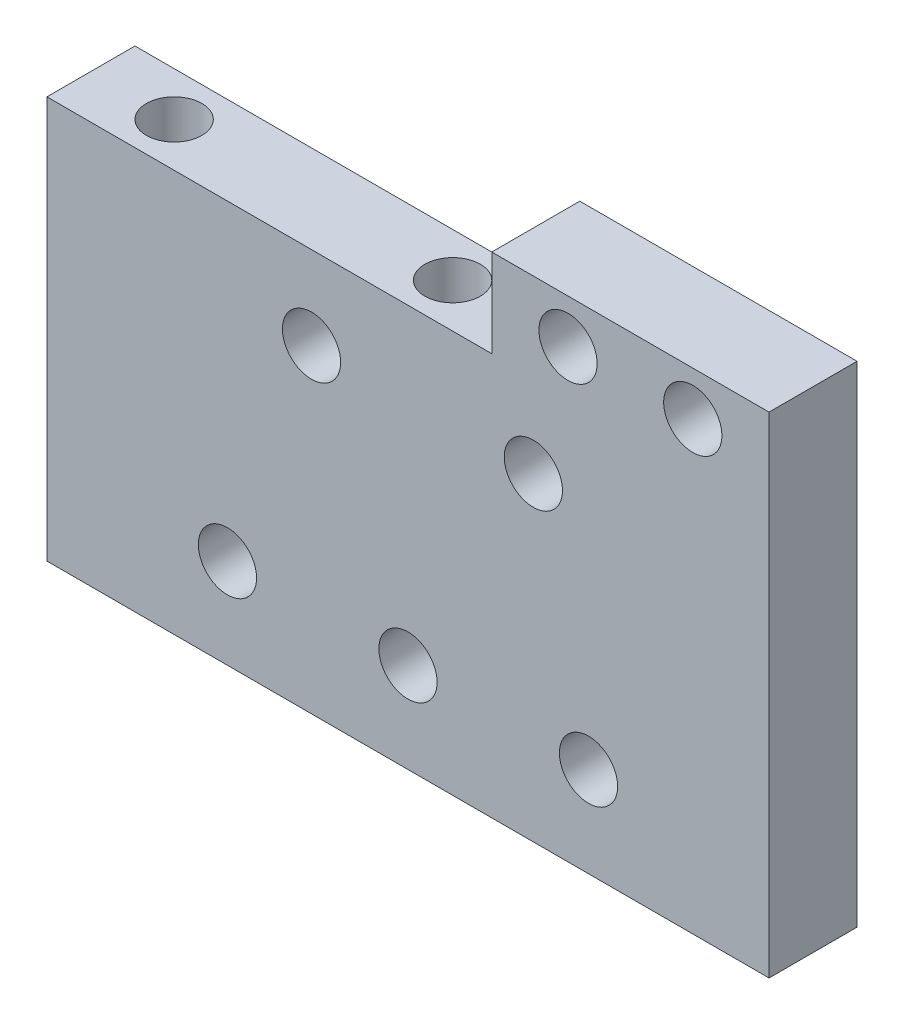
ISO-10303-21;
HEADER;
FILE_DESCRIPTION(('STEP AP214'),'2;1');
FILE_NAME('part.step','',(''),(''),'','','');
FILE_SCHEMA(('AUTOMOTIVE_DESIGN { 1 0 10303 214 1 1 1 1 }'));
ENDSEC;
DATA;
#1=APPLICATION_CONTEXT('core data for automotive mechanical design processes');
#2=APPLICATION_PROTOCOL_DEFINITION('international standard','automotive_design',2000,#1);
#3=PRODUCT_CONTEXT('',#1,'mechanical');
#4=PRODUCT('Part','Part','',(#3));
#5=PRODUCT_RELATED_PRODUCT_CATEGORY('part','',(#4));
#6=PRODUCT_DEFINITION_FORMATION('','',#4);
#7=PRODUCT_DEFINITION_CONTEXT('part definition',#1,'design');
#8=PRODUCT_DEFINITION('design','',#6,#7);
#9=PRODUCT_DEFINITION_SHAPE('','',#8);
#10=(LENGTH_UNIT() NAMED_UNIT(*) SI_UNIT(.MILLI.,.METRE.));
#11=(NAMED_UNIT(*) PLANE_ANGLE_UNIT() SI_UNIT($,.RADIAN.));
#12=(NAMED_UNIT(*) SI_UNIT($,.STERADIAN.) SOLID_ANGLE_UNIT());
#13=UNCERTAINTY_MEASURE_WITH_UNIT(LENGTH_MEASURE(1.E-05),#10,'distance_accuracy_value','');
#14=(GEOMETRIC_REPRESENTATION_CONTEXT(3) GLOBAL_UNCERTAINTY_ASSIGNED_CONTEXT((#13)) GLOBAL_UNIT_ASSIGNED_CONTEXT((#10,
#11,#12)) REPRESENTATION_CONTEXT('',''));
#15=CARTESIAN_POINT('',(0.,0.,0.));
#16=DIRECTION('',(0.,0.,1.));
#17=DIRECTION('',(1.,0.,0.));
#18=AXIS2_PLACEMENT_3D('',#15,#16,#17);
#19=CARTESIAN_POINT('',(89.9999999999999,0.,6.35));
#20=DIRECTION('',(0.,0.,-1.));
#21=DIRECTION('',(-1.,0.,0.));
#22=AXIS2_PLACEMENT_3D('',#19,#20,#21);
#23=PLANE('',#22);
#24=CARTESIAN_POINT('',(77.,-5.99999999999999,6.35));
#25=DIRECTION('',(0.,0.,1.));
#26=DIRECTION('',(1.,0.,0.));
#27=AXIS2_PLACEMENT_3D('',#24,#25,#26);
#28=CIRCLE('',#27,2.10000000000002);
#29=CARTESIAN_POINT('',(79.1,-5.99999999999999,6.35));
#30=VERTEX_POINT('',#29);
#31=EDGE_CURVE('E217',#30,#30,#28,.T.);
#32=ORIENTED_EDGE('',*,*,#31,.F.);
#33=EDGE_LOOP('',(#32));
#34=FACE_BOUND('',#33,.T.);
#35=CARTESIAN_POINT('',(93.,-5.99999999999999,6.35));
#36=DIRECTION('',(0.,0.,1.));
#37=DIRECTION('',(1.,0.,0.));
#38=AXIS2_PLACEMENT_3D('',#35,#36,#37);
#39=CIRCLE('',#38,2.10000000000002);
#40=CARTESIAN_POINT('',(95.1,-5.99999999999999,6.35));
#41=VERTEX_POINT('',#40);
#42=EDGE_CURVE('E222',#41,#41,#39,.T.);
#43=ORIENTED_EDGE('',*,*,#42,.F.);
#44=EDGE_LOOP('',(#43));
#45=FACE_BOUND('',#44,.T.);
#46=CARTESIAN_POINT('',(96.9786264722931,-22.5,6.35));
#47=DIRECTION('',(0.,0.,1.));
#48=DIRECTION('',(1.,0.,0.));
#49=AXIS2_PLACEMENT_3D('',#46,#47,#48);
#50=CIRCLE('',#49,2.10000000000002);
#51=CARTESIAN_POINT('',(99.0786264722931,-22.5,6.35));
#52=VERTEX_POINT('',#51);
#53=EDGE_CURVE('E228',#52,#52,#50,.T.);
#54=ORIENTED_EDGE('',*,*,#53,.F.);
#55=EDGE_LOOP('',(#54));
#56=FACE_BOUND('',#55,.T.);
#57=CARTESIAN_POINT('',(83.9572529445862,-22.5,6.35));
#58=DIRECTION('',(0.,0.,1.));
#59=DIRECTION('',(1.,0.,0.));
#60=AXIS2_PLACEMENT_3D('',#57,#58,#59);
#61=CIRCLE('',#60,2.10000000000002);
#62=CARTESIAN_POINT('',(86.0572529445862,-22.5,6.35));
#63=VERTEX_POINT('',#62);
#64=EDGE_CURVE('E234',#63,#63,#61,.T.);
#65=ORIENTED_EDGE('',*,*,#64,.F.);
#66=EDGE_LOOP('',(#65));
#67=FACE_BOUND('',#66,.T.);
#68=CARTESIAN_POINT('',(70.9358794168792,-22.5,6.35));
#69=DIRECTION('',(0.,0.,1.));
#70=DIRECTION('',(1.,0.,0.));
#71=AXIS2_PLACEMENT_3D('',#68,#69,#70);
#72=CIRCLE('',#71,2.10000000000002);
#73=CARTESIAN_POINT('',(73.0358794168793,-22.5,6.35));
#74=VERTEX_POINT('',#73);
#75=EDGE_CURVE('E240',#74,#74,#72,.T.);
#76=ORIENTED_EDGE('',*,*,#75,.F.);
#77=EDGE_LOOP('',(#76));
#78=FACE_BOUND('',#77,.T.);
#79=CARTESIAN_POINT('',(95.5,3.175,6.35));
#80=DIRECTION('',(0.,0.,1.));
#81=DIRECTION('',(1.,0.,0.));
#82=AXIS2_PLACEMENT_3D('',#79,#80,#81);
#83=CIRCLE('',#82,2.1);
#84=CARTESIAN_POINT('',(97.6,3.175,6.35));
#85=VERTEX_POINT('',#84);
#86=EDGE_CURVE('E120',#85,#85,#83,.T.);
#87=ORIENTED_EDGE('',*,*,#86,.F.);
#88=EDGE_LOOP('',(#87));
#89=FACE_BOUND('',#88,.T.);
#90=DIRECTION('',(0.,-1.,0.));
#91=VECTOR('',#90,1.);
#92=CARTESIAN_POINT('',(89.9999999999999,6.35,6.35));
#93=LINE('',#92,#91);
#94=CARTESIAN_POINT('',(89.9999999999999,6.35,6.35));
#95=VERTEX_POINT('',#94);
#96=CARTESIAN_POINT('',(89.9999999999999,0.,6.35));
#97=VERTEX_POINT('',#96);
#98=EDGE_CURVE('E127',#95,#97,#93,.T.);
#99=ORIENTED_EDGE('',*,*,#98,.T.);
#100=DIRECTION('',(-1.,0.,0.));
#101=VECTOR('',#100,1.);
#102=CARTESIAN_POINT('',(89.9999999999999,0.,6.35));
#103=LINE('',#102,#101);
#104=CARTESIAN_POINT('',(57.9145058891723,0.,6.35));
#105=VERTEX_POINT('',#104);
#106=EDGE_CURVE('E85',#97,#105,#103,.T.);
#107=ORIENTED_EDGE('',*,*,#106,.T.);
#108=DIRECTION('',(0.,-1.,0.));
#109=VECTOR('',#108,1.);
#110=CARTESIAN_POINT('',(57.9145058891723,0.,6.35));
#111=LINE('',#110,#109);
#112=CARTESIAN_POINT('',(57.9145058891723,-29.,6.35));
#113=VERTEX_POINT('',#112);
#114=EDGE_CURVE('E98',#105,#113,#111,.T.);
#115=ORIENTED_EDGE('',*,*,#114,.T.);
#116=DIRECTION('',(1.,0.,0.));
#117=VECTOR('',#116,1.);
#118=CARTESIAN_POINT('',(57.9145058891723,-29.,6.35));
#119=LINE('',#118,#117);
#120=CARTESIAN_POINT('',(110.,-29.,6.35));
#121=VERTEX_POINT('',#120);
#122=EDGE_CURVE('E92',#113,#121,#119,.T.);
#123=ORIENTED_EDGE('',*,*,#122,.T.);
#124=DIRECTION('',(0.,1.,0.));
#125=VECTOR('',#124,1.);
#126=CARTESIAN_POINT('',(110.,6.35,6.35));
#127=LINE('',#126,#125);
#128=CARTESIAN_POINT('',(110.,6.35,6.35));
#129=VERTEX_POINT('',#128);
#130=EDGE_CURVE('E96',#121,#129,#127,.T.);
#131=ORIENTED_EDGE('',*,*,#130,.T.);
#132=DIRECTION('',(-1.,0.,0.));
#133=VECTOR('',#132,1.);
#134=CARTESIAN_POINT('',(89.9999999999999,6.35,6.35));
#135=LINE('',#134,#133);
#136=EDGE_CURVE('E48',#129,#95,#135,.T.);
#137=ORIENTED_EDGE('',*,*,#136,.T.);
#138=EDGE_LOOP('',(#99,#107,#115,#123,#131,#137));
#139=FACE_BOUND('',#138,.T.);
#140=CARTESIAN_POINT('',(104.5,3.175,6.35));
#141=DIRECTION('',(0.,0.,1.));
#142=DIRECTION('',(1.,0.,0.));
#143=AXIS2_PLACEMENT_3D('',#140,#141,#142);
#144=CIRCLE('',#143,2.1);
#145=CARTESIAN_POINT('',(106.6,3.175,6.35));
#146=VERTEX_POINT('',#145);
#147=EDGE_CURVE('E249',#146,#146,#144,.T.);
#148=ORIENTED_EDGE('',*,*,#147,.F.);
#149=EDGE_LOOP('',(#148));
#150=FACE_BOUND('',#149,.T.);
#151=ADVANCED_FACE('F31',(#34,#45,#56,#67,#78,#89,#139,#150),#23,.F.);
#152=CARTESIAN_POINT('',(89.9999999999999,0.,0.));
#153=DIRECTION('',(0.,0.,-1.));
#154=DIRECTION('',(-1.,0.,0.));
#155=AXIS2_PLACEMENT_3D('',#152,#153,#154);
#156=PLANE('',#155);
#157=CARTESIAN_POINT('',(77.,-5.99999999999999,0.));
#158=DIRECTION('',(0.,0.,1.));
#159=DIRECTION('',(1.,0.,0.));
#160=AXIS2_PLACEMENT_3D('',#157,#158,#159);
#161=CIRCLE('',#160,2.10000000000002);
#162=CARTESIAN_POINT('',(79.1,-5.99999999999999,0.));
#163=VERTEX_POINT('',#162);
#164=EDGE_CURVE('E219',#163,#163,#161,.T.);
#165=ORIENTED_EDGE('',*,*,#164,.T.);
#166=EDGE_LOOP('',(#165));
#167=FACE_BOUND('',#166,.T.);
#168=CARTESIAN_POINT('',(93.,-5.99999999999999,0.));
#169=DIRECTION('',(0.,0.,1.));
#170=DIRECTION('',(1.,0.,0.));
#171=AXIS2_PLACEMENT_3D('',#168,#169,#170);
#172=CIRCLE('',#171,2.10000000000002);
#173=CARTESIAN_POINT('',(95.1,-5.99999999999999,0.));
#174=VERTEX_POINT('',#173);
#175=EDGE_CURVE('E225',#174,#174,#172,.T.);
#176=ORIENTED_EDGE('',*,*,#175,.T.);
#177=EDGE_LOOP('',(#176));
#178=FACE_BOUND('',#177,.T.);
#179=CARTESIAN_POINT('',(96.9786264722931,-22.5,0.));
#180=DIRECTION('',(0.,0.,1.));
#181=DIRECTION('',(1.,0.,0.));
#182=AXIS2_PLACEMENT_3D('',#179,#180,#181);
#183=CIRCLE('',#182,2.10000000000002);
#184=CARTESIAN_POINT('',(99.0786264722931,-22.5,0.));
#185=VERTEX_POINT('',#184);
#186=EDGE_CURVE('E231',#185,#185,#183,.T.);
#187=ORIENTED_EDGE('',*,*,#186,.T.);
#188=EDGE_LOOP('',(#187));
#189=FACE_BOUND('',#188,.T.);
#190=CARTESIAN_POINT('',(83.9572529445862,-22.5,0.));
#191=DIRECTION('',(0.,0.,1.));
#192=DIRECTION('',(1.,0.,0.));
#193=AXIS2_PLACEMENT_3D('',#190,#191,#192);
#194=CIRCLE('',#193,2.10000000000002);
#195=CARTESIAN_POINT('',(86.0572529445862,-22.5,0.));
#196=VERTEX_POINT('',#195);
#197=EDGE_CURVE('E237',#196,#196,#194,.T.);
#198=ORIENTED_EDGE('',*,*,#197,.T.);
#199=EDGE_LOOP('',(#198));
#200=FACE_BOUND('',#199,.T.);
#201=CARTESIAN_POINT('',(70.9358794168792,-22.5,0.));
#202=DIRECTION('',(0.,0.,1.));
#203=DIRECTION('',(1.,0.,0.));
#204=AXIS2_PLACEMENT_3D('',#201,#202,#203);
#205=CIRCLE('',#204,2.10000000000002);
#206=CARTESIAN_POINT('',(73.0358794168793,-22.5,0.));
#207=VERTEX_POINT('',#206);
#208=EDGE_CURVE('E243',#207,#207,#205,.T.);
#209=ORIENTED_EDGE('',*,*,#208,.T.);
#210=EDGE_LOOP('',(#209));
#211=FACE_BOUND('',#210,.T.);
#212=CARTESIAN_POINT('',(95.5,3.175,0.));
#213=DIRECTION('',(0.,0.,1.));
#214=DIRECTION('',(1.,0.,0.));
#215=AXIS2_PLACEMENT_3D('',#212,#213,#214);
#216=CIRCLE('',#215,2.1);
#217=CARTESIAN_POINT('',(97.6,3.175,0.));
#218=VERTEX_POINT('',#217);
#219=EDGE_CURVE('E252',#218,#218,#216,.T.);
#220=ORIENTED_EDGE('',*,*,#219,.T.);
#221=EDGE_LOOP('',(#220));
#222=FACE_BOUND('',#221,.T.);
#223=DIRECTION('',(0.,-1.,0.));
#224=VECTOR('',#223,1.);
#225=CARTESIAN_POINT('',(89.9999999999999,6.35,0.));
#226=LINE('',#225,#224);
#227=CARTESIAN_POINT('',(89.9999999999999,6.35,0.));
#228=VERTEX_POINT('',#227);
#229=CARTESIAN_POINT('',(89.9999999999999,0.,0.));
#230=VERTEX_POINT('',#229);
#231=EDGE_CURVE('E116',#228,#230,#226,.T.);
#232=ORIENTED_EDGE('',*,*,#231,.F.);
#233=DIRECTION('',(-1.,0.,0.));
#234=VECTOR('',#233,1.);
#235=CARTESIAN_POINT('',(89.9999999999999,6.35,0.));
#236=LINE('',#235,#234);
#237=CARTESIAN_POINT('',(110.,6.35,0.));
#238=VERTEX_POINT('',#237);
#239=EDGE_CURVE('E77',#238,#228,#236,.T.);
#240=ORIENTED_EDGE('',*,*,#239,.F.);
#241=DIRECTION('',(0.,1.,0.));
#242=VECTOR('',#241,1.);
#243=CARTESIAN_POINT('',(110.,6.35,0.));
#244=LINE('',#243,#242);
#245=CARTESIAN_POINT('',(110.,-29.,0.));
#246=VERTEX_POINT('',#245);
#247=EDGE_CURVE('E71',#246,#238,#244,.T.);
#248=ORIENTED_EDGE('',*,*,#247,.F.);
#249=DIRECTION('',(1.,0.,0.));
#250=VECTOR('',#249,1.);
#251=CARTESIAN_POINT('',(57.9145058891723,-29.,0.));
#252=LINE('',#251,#250);
#253=CARTESIAN_POINT('',(57.9145058891723,-29.,0.));
#254=VERTEX_POINT('',#253);
#255=EDGE_CURVE('E106',#254,#246,#252,.T.);
#256=ORIENTED_EDGE('',*,*,#255,.F.);
#257=DIRECTION('',(0.,-1.,0.));
#258=VECTOR('',#257,1.);
#259=CARTESIAN_POINT('',(57.9145058891723,0.,0.));
#260=LINE('',#259,#258);
#261=CARTESIAN_POINT('',(57.9145058891723,0.,0.));
#262=VERTEX_POINT('',#261);
#263=EDGE_CURVE('E122',#262,#254,#260,.T.);
#264=ORIENTED_EDGE('',*,*,#263,.F.);
#265=DIRECTION('',(-1.,0.,0.));
#266=VECTOR('',#265,1.);
#267=CARTESIAN_POINT('',(89.9999999999999,0.,0.));
#268=LINE('',#267,#266);
#269=EDGE_CURVE('E119',#230,#262,#268,.T.);
#270=ORIENTED_EDGE('',*,*,#269,.F.);
#271=EDGE_LOOP('',(#232,#240,#248,#256,#264,#270));
#272=FACE_BOUND('',#271,.T.);
#273=CARTESIAN_POINT('',(104.5,3.175,0.));
#274=DIRECTION('',(0.,0.,1.));
#275=DIRECTION('',(1.,0.,0.));
#276=AXIS2_PLACEMENT_3D('',#273,#274,#275);
#277=CIRCLE('',#276,2.1);
#278=CARTESIAN_POINT('',(106.6,3.175,0.));
#279=VERTEX_POINT('',#278);
#280=EDGE_CURVE('E246',#279,#279,#277,.T.);
#281=ORIENTED_EDGE('',*,*,#280,.T.);
#282=EDGE_LOOP('',(#281));
#283=FACE_BOUND('',#282,.T.);
#284=ADVANCED_FACE('F136',(#167,#178,#189,#200,#211,#222,#272,#283),#156,.T.);
#285=CARTESIAN_POINT('',(89.9999999999999,6.35,6.35));
#286=DIRECTION('',(1.,0.,0.));
#287=DIRECTION('',(0.,0.,-1.));
#288=AXIS2_PLACEMENT_3D('',#285,#286,#287);
#289=PLANE('',#288);
#290=ORIENTED_EDGE('',*,*,#231,.T.);
#291=DIRECTION('',(0.,0.,-1.));
#292=VECTOR('',#291,1.);
#293=CARTESIAN_POINT('',(89.9999999999999,0.,6.35));
#294=LINE('',#293,#292);
#295=EDGE_CURVE('E11',#97,#230,#294,.T.);
#296=ORIENTED_EDGE('',*,*,#295,.F.);
#297=ORIENTED_EDGE('',*,*,#98,.F.);
#298=DIRECTION('',(0.,0.,-1.));
#299=VECTOR('',#298,1.);
#300=CARTESIAN_POINT('',(89.9999999999999,6.35,6.35));
#301=LINE('',#300,#299);
#302=EDGE_CURVE('E112',#95,#228,#301,.T.);
#303=ORIENTED_EDGE('',*,*,#302,.T.);
#304=EDGE_LOOP('',(#290,#296,#297,#303));
#305=FACE_BOUND('',#304,.T.);
#306=ADVANCED_FACE('F33',(#305),#289,.F.);
#307=CARTESIAN_POINT('',(89.9999999999999,0.,6.35));
#308=DIRECTION('',(0.,-1.,0.));
#309=DIRECTION('',(0.,0.,-1.));
#310=AXIS2_PLACEMENT_3D('',#307,#308,#309);
#311=PLANE('',#310);
#312=CARTESIAN_POINT('',(63.9145058891723,0.,3.17500000000001));
#313=DIRECTION('',(0.,1.,0.));
#314=DIRECTION('',(0.,0.,1.));
#315=AXIS2_PLACEMENT_3D('',#312,#313,#314);
#316=CIRCLE('',#315,2.);
#317=CARTESIAN_POINT('',(63.9145058891723,0.,5.17500000000001));
#318=VERTEX_POINT('',#317);
#319=EDGE_CURVE('E208',#318,#318,#316,.T.);
#320=ORIENTED_EDGE('',*,*,#319,.F.);
#321=EDGE_LOOP('',(#320));
#322=FACE_BOUND('',#321,.T.);
#323=CARTESIAN_POINT('',(83.9999999999999,0.,3.17500000000001));
#324=DIRECTION('',(0.,1.,0.));
#325=DIRECTION('',(0.,0.,1.));
#326=AXIS2_PLACEMENT_3D('',#323,#324,#325);
#327=CIRCLE('',#326,2.);
#328=CARTESIAN_POINT('',(83.9999999999999,0.,5.17500000000001));
#329=VERTEX_POINT('',#328);
#330=EDGE_CURVE('E207',#329,#329,#327,.T.);
#331=ORIENTED_EDGE('',*,*,#330,.F.);
#332=EDGE_LOOP('',(#331));
#333=FACE_BOUND('',#332,.T.);
#334=ORIENTED_EDGE('',*,*,#269,.T.);
#335=DIRECTION('',(0.,0.,-1.));
#336=VECTOR('',#335,1.);
#337=CARTESIAN_POINT('',(57.9145058891723,0.,6.35));
#338=LINE('',#337,#336);
#339=EDGE_CURVE('E40',#105,#262,#338,.T.);
#340=ORIENTED_EDGE('',*,*,#339,.F.);
#341=ORIENTED_EDGE('',*,*,#106,.F.);
#342=ORIENTED_EDGE('',*,*,#295,.T.);
#343=EDGE_LOOP('',(#334,#340,#341,#342));
#344=FACE_BOUND('',#343,.T.);
#345=ADVANCED_FACE('F293',(#322,#333,#344),#311,.F.);
#346=CARTESIAN_POINT('',(57.9145058891723,0.,6.35));
#347=DIRECTION('',(1.,0.,0.));
#348=DIRECTION('',(0.,1.,0.));
#349=AXIS2_PLACEMENT_3D('',#346,#347,#348);
#350=PLANE('',#349);
#351=ORIENTED_EDGE('',*,*,#263,.T.);
#352=DIRECTION('',(0.,0.,-1.));
#353=VECTOR('',#352,1.);
#354=CARTESIAN_POINT('',(57.9145058891723,-29.,6.35));
#355=LINE('',#354,#353);
#356=EDGE_CURVE('E107',#113,#254,#355,.T.);
#357=ORIENTED_EDGE('',*,*,#356,.F.);
#358=ORIENTED_EDGE('',*,*,#114,.F.);
#359=ORIENTED_EDGE('',*,*,#339,.T.);
#360=EDGE_LOOP('',(#351,#357,#358,#359));
#361=FACE_BOUND('',#360,.T.);
#362=ADVANCED_FACE('F133',(#361),#350,.F.);
#363=CARTESIAN_POINT('',(57.9145058891723,-29.,6.35));
#364=DIRECTION('',(0.,1.,0.));
#365=DIRECTION('',(0.,0.,1.));
#366=AXIS2_PLACEMENT_3D('',#363,#364,#365);
#367=PLANE('',#366);
#368=ORIENTED_EDGE('',*,*,#255,.T.);
#369=DIRECTION('',(0.,0.,-1.));
#370=VECTOR('',#369,1.);
#371=CARTESIAN_POINT('',(110.,-29.,6.35));
#372=LINE('',#371,#370);
#373=EDGE_CURVE('E103',#121,#246,#372,.T.);
#374=ORIENTED_EDGE('',*,*,#373,.F.);
#375=ORIENTED_EDGE('',*,*,#122,.F.);
#376=ORIENTED_EDGE('',*,*,#356,.T.);
#377=EDGE_LOOP('',(#368,#374,#375,#376));
#378=FACE_BOUND('',#377,.T.);
#379=ADVANCED_FACE('F104',(#378),#367,.F.);
#380=CARTESIAN_POINT('',(110.,6.35,6.35));
#381=DIRECTION('',(-1.,0.,0.));
#382=DIRECTION('',(0.,-1.,0.));
#383=AXIS2_PLACEMENT_3D('',#380,#381,#382);
#384=PLANE('',#383);
#385=ORIENTED_EDGE('',*,*,#247,.T.);
#386=DIRECTION('',(0.,0.,-1.));
#387=VECTOR('',#386,1.);
#388=CARTESIAN_POINT('',(110.,6.35,6.35));
#389=LINE('',#388,#387);
#390=EDGE_CURVE('E108',#129,#238,#389,.T.);
#391=ORIENTED_EDGE('',*,*,#390,.F.);
#392=ORIENTED_EDGE('',*,*,#130,.F.);
#393=ORIENTED_EDGE('',*,*,#373,.T.);
#394=EDGE_LOOP('',(#385,#391,#392,#393));
#395=FACE_BOUND('',#394,.T.);
#396=ADVANCED_FACE('F110',(#395),#384,.F.);
#397=CARTESIAN_POINT('',(89.9999999999999,6.35,6.35));
#398=DIRECTION('',(0.,-1.,0.));
#399=DIRECTION('',(0.,0.,-1.));
#400=AXIS2_PLACEMENT_3D('',#397,#398,#399);
#401=PLANE('',#400);
#402=ORIENTED_EDGE('',*,*,#239,.T.);
#403=ORIENTED_EDGE('',*,*,#302,.F.);
#404=ORIENTED_EDGE('',*,*,#136,.F.);
#405=ORIENTED_EDGE('',*,*,#390,.T.);
#406=EDGE_LOOP('',(#402,#403,#404,#405));
#407=FACE_BOUND('',#406,.T.);
#408=ADVANCED_FACE('F141',(#407),#401,.F.);
#409=CARTESIAN_POINT('',(95.5,3.175,6.35));
#410=DIRECTION('',(0.,0.,-1.));
#411=DIRECTION('',(-1.,0.,0.));
#412=AXIS2_PLACEMENT_3D('',#409,#410,#411);
#413=CYLINDRICAL_SURFACE('',#412,2.1);
#414=ORIENTED_EDGE('',*,*,#86,.T.);
#415=EDGE_LOOP('',(#414));
#416=FACE_BOUND('',#415,.T.);
#417=ORIENTED_EDGE('',*,*,#219,.F.);
#418=EDGE_LOOP('',(#417));
#419=FACE_BOUND('',#418,.T.);
#420=ADVANCED_FACE('F143',(#416,#419),#413,.F.);
#421=CARTESIAN_POINT('',(104.5,3.175,6.35));
#422=DIRECTION('',(0.,0.,-1.));
#423=DIRECTION('',(-1.,0.,0.));
#424=AXIS2_PLACEMENT_3D('',#421,#422,#423);
#425=CYLINDRICAL_SURFACE('',#424,2.1);
#426=ORIENTED_EDGE('',*,*,#147,.T.);
#427=EDGE_LOOP('',(#426));
#428=FACE_BOUND('',#427,.T.);
#429=ORIENTED_EDGE('',*,*,#280,.F.);
#430=EDGE_LOOP('',(#429));
#431=FACE_BOUND('',#430,.T.);
#432=ADVANCED_FACE('F149',(#428,#431),#425,.F.);
#433=CARTESIAN_POINT('',(70.9358794168792,-22.5,0.));
#434=DIRECTION('',(0.,0.,1.));
#435=DIRECTION('',(1.,0.,0.));
#436=AXIS2_PLACEMENT_3D('',#433,#434,#435);
#437=CYLINDRICAL_SURFACE('',#436,2.10000000000002);
#438=ORIENTED_EDGE('',*,*,#208,.F.);
#439=EDGE_LOOP('',(#438));
#440=FACE_BOUND('',#439,.T.);
#441=ORIENTED_EDGE('',*,*,#75,.T.);
#442=EDGE_LOOP('',(#441));
#443=FACE_BOUND('',#442,.T.);
#444=ADVANCED_FACE('F166',(#440,#443),#437,.F.);
#445=CARTESIAN_POINT('',(83.9572529445862,-22.5,0.));
#446=DIRECTION('',(0.,0.,1.));
#447=DIRECTION('',(1.,0.,0.));
#448=AXIS2_PLACEMENT_3D('',#445,#446,#447);
#449=CYLINDRICAL_SURFACE('',#448,2.10000000000002);
#450=ORIENTED_EDGE('',*,*,#197,.F.);
#451=EDGE_LOOP('',(#450));
#452=FACE_BOUND('',#451,.T.);
#453=ORIENTED_EDGE('',*,*,#64,.T.);
#454=EDGE_LOOP('',(#453));
#455=FACE_BOUND('',#454,.T.);
#456=ADVANCED_FACE('F170',(#452,#455),#449,.F.);
#457=CARTESIAN_POINT('',(96.9786264722931,-22.5,0.));
#458=DIRECTION('',(0.,0.,1.));
#459=DIRECTION('',(1.,0.,0.));
#460=AXIS2_PLACEMENT_3D('',#457,#458,#459);
#461=CYLINDRICAL_SURFACE('',#460,2.10000000000002);
#462=ORIENTED_EDGE('',*,*,#186,.F.);
#463=EDGE_LOOP('',(#462));
#464=FACE_BOUND('',#463,.T.);
#465=ORIENTED_EDGE('',*,*,#53,.T.);
#466=EDGE_LOOP('',(#465));
#467=FACE_BOUND('',#466,.T.);
#468=ADVANCED_FACE('F174',(#464,#467),#461,.F.);
#469=CARTESIAN_POINT('',(93.,-5.99999999999999,0.));
#470=DIRECTION('',(0.,0.,1.));
#471=DIRECTION('',(1.,0.,0.));
#472=AXIS2_PLACEMENT_3D('',#469,#470,#471);
#473=CYLINDRICAL_SURFACE('',#472,2.10000000000002);
#474=ORIENTED_EDGE('',*,*,#175,.F.);
#475=EDGE_LOOP('',(#474));
#476=FACE_BOUND('',#475,.T.);
#477=ORIENTED_EDGE('',*,*,#42,.T.);
#478=EDGE_LOOP('',(#477));
#479=FACE_BOUND('',#478,.T.);
#480=ADVANCED_FACE('F178',(#476,#479),#473,.F.);
#481=CARTESIAN_POINT('',(77.,-5.99999999999999,0.));
#482=DIRECTION('',(0.,0.,1.));
#483=DIRECTION('',(1.,0.,0.));
#484=AXIS2_PLACEMENT_3D('',#481,#482,#483);
#485=CYLINDRICAL_SURFACE('',#484,2.10000000000002);
#486=ORIENTED_EDGE('',*,*,#164,.F.);
#487=EDGE_LOOP('',(#486));
#488=FACE_BOUND('',#487,.T.);
#489=ORIENTED_EDGE('',*,*,#31,.T.);
#490=EDGE_LOOP('',(#489));
#491=FACE_BOUND('',#490,.T.);
#492=ADVANCED_FACE('F182',(#488,#491),#485,.F.);
#493=CARTESIAN_POINT('',(83.9999999999999,-8.,3.17500000000001));
#494=DIRECTION('',(0.,1.,0.));
#495=DIRECTION('',(0.,0.,1.));
#496=AXIS2_PLACEMENT_3D('',#493,#494,#495);
#497=CYLINDRICAL_SURFACE('',#496,2.);
#498=CARTESIAN_POINT('',(83.9999999999999,-8.,3.17500000000001));
#499=DIRECTION('',(0.,1.,0.));
#500=DIRECTION('',(0.,0.,1.));
#501=AXIS2_PLACEMENT_3D('',#498,#499,#500);
#502=CIRCLE('',#501,2.);
#503=CARTESIAN_POINT('',(83.9999999999999,-8.,5.17500000000001));
#504=VERTEX_POINT('',#503);
#505=EDGE_CURVE('E211',#504,#504,#502,.T.);
#506=ORIENTED_EDGE('',*,*,#505,.F.);
#507=EDGE_LOOP('',(#506));
#508=FACE_BOUND('',#507,.T.);
#509=ORIENTED_EDGE('',*,*,#330,.T.);
#510=EDGE_LOOP('',(#509));
#511=FACE_BOUND('',#510,.T.);
#512=ADVANCED_FACE('F186',(#508,#511),#497,.F.);
#513=CARTESIAN_POINT('',(83.9999999999999,-8.,3.17500000000001));
#514=DIRECTION('',(0.,1.,0.));
#515=DIRECTION('',(0.,0.,1.));
#516=AXIS2_PLACEMENT_3D('',#513,#514,#515);
#517=PLANE('',#516);
#518=ORIENTED_EDGE('',*,*,#505,.T.);
#519=EDGE_LOOP('',(#518));
#520=FACE_BOUND('',#519,.T.);
#521=ADVANCED_FACE('F190',(#520),#517,.T.);
#522=CARTESIAN_POINT('',(63.9145058891723,-8.,3.17500000000001));
#523=DIRECTION('',(0.,1.,0.));
#524=DIRECTION('',(0.,0.,1.));
#525=AXIS2_PLACEMENT_3D('',#522,#523,#524);
#526=CYLINDRICAL_SURFACE('',#525,2.);
#527=CARTESIAN_POINT('',(63.9145058891723,-8.,3.17500000000001));
#528=DIRECTION('',(0.,1.,0.));
#529=DIRECTION('',(0.,0.,1.));
#530=AXIS2_PLACEMENT_3D('',#527,#528,#529);
#531=CIRCLE('',#530,2.);
#532=CARTESIAN_POINT('',(63.9145058891723,-8.,5.17500000000001));
#533=VERTEX_POINT('',#532);
#534=EDGE_CURVE('E206',#533,#533,#531,.T.);
#535=ORIENTED_EDGE('',*,*,#534,.F.);
#536=EDGE_LOOP('',(#535));
#537=FACE_BOUND('',#536,.T.);
#538=ORIENTED_EDGE('',*,*,#319,.T.);
#539=EDGE_LOOP('',(#538));
#540=FACE_BOUND('',#539,.T.);
#541=ADVANCED_FACE('F194',(#537,#540),#526,.F.);
#542=CARTESIAN_POINT('',(63.9145058891723,-8.,3.17500000000001));
#543=DIRECTION('',(0.,1.,0.));
#544=DIRECTION('',(0.,0.,1.));
#545=AXIS2_PLACEMENT_3D('',#542,#543,#544);
#546=PLANE('',#545);
#547=ORIENTED_EDGE('',*,*,#534,.T.);
#548=EDGE_LOOP('',(#547));
#549=FACE_BOUND('',#548,.T.);
#550=ADVANCED_FACE('F198',(#549),#546,.T.);
#551=CLOSED_SHELL('',(#151,#284,#306,#345,#362,#379,#396,#408,#420,#432,#444,#456,#468,#480,
#492,#512,#521,#541,#550));
#552=MANIFOLD_SOLID_BREP('B2',#551);
#553=ADVANCED_BREP_SHAPE_REPRESENTATION('',(#18,#552),#14);
#554=SHAPE_DEFINITION_REPRESENTATION(#9,#553);
ENDSEC;
END-ISO-10303-21;
